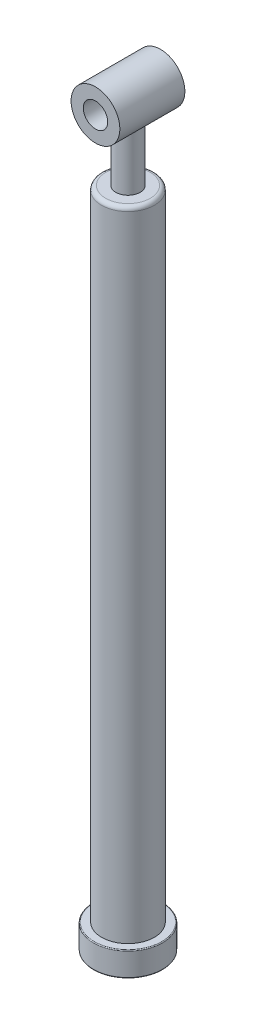
ISO-10303-21;
HEADER;
FILE_DESCRIPTION(('STEP AP214'),'2;1');
FILE_NAME('part.step','',(''),(''),'','','');
FILE_SCHEMA(('AUTOMOTIVE_DESIGN { 1 0 10303 214 1 1 1 1 }'));
ENDSEC;
DATA;
#1=APPLICATION_CONTEXT('core data for automotive mechanical design processes');
#2=APPLICATION_PROTOCOL_DEFINITION('international standard','automotive_design',2000,#1);
#3=PRODUCT_CONTEXT('',#1,'mechanical');
#4=PRODUCT('Part','Part','',(#3));
#5=PRODUCT_RELATED_PRODUCT_CATEGORY('part','',(#4));
#6=PRODUCT_DEFINITION_FORMATION('','',#4);
#7=PRODUCT_DEFINITION_CONTEXT('part definition',#1,'design');
#8=PRODUCT_DEFINITION('design','',#6,#7);
#9=PRODUCT_DEFINITION_SHAPE('','',#8);
#10=(LENGTH_UNIT() NAMED_UNIT(*) SI_UNIT(.MILLI.,.METRE.));
#11=(NAMED_UNIT(*) PLANE_ANGLE_UNIT() SI_UNIT($,.RADIAN.));
#12=(NAMED_UNIT(*) SI_UNIT($,.STERADIAN.) SOLID_ANGLE_UNIT());
#13=UNCERTAINTY_MEASURE_WITH_UNIT(LENGTH_MEASURE(1.E-05),#10,'distance_accuracy_value','');
#14=(GEOMETRIC_REPRESENTATION_CONTEXT(3) GLOBAL_UNCERTAINTY_ASSIGNED_CONTEXT((#13)) GLOBAL_UNIT_ASSIGNED_CONTEXT((#10,
#11,#12)) REPRESENTATION_CONTEXT('',''));
#15=CARTESIAN_POINT('',(0.,0.,0.));
#16=DIRECTION('',(0.,0.,1.));
#17=DIRECTION('',(1.,0.,0.));
#18=AXIS2_PLACEMENT_3D('',#15,#16,#17);
#19=CARTESIAN_POINT('',(0.,392.5,0.));
#20=DIRECTION('',(0.,-1.,0.));
#21=DIRECTION('',(0.,0.,-1.));
#22=AXIS2_PLACEMENT_3D('',#19,#20,#21);
#23=CYLINDRICAL_SURFACE('',#22,32.5);
#24=CARTESIAN_POINT('',(0.,387.5,0.));
#25=DIRECTION('',(0.,1.,0.));
#26=DIRECTION('',(0.,0.,1.));
#27=AXIS2_PLACEMENT_3D('',#24,#25,#26);
#28=CIRCLE('',#27,32.5);
#29=CARTESIAN_POINT('',(0.,387.5,32.5));
#30=VERTEX_POINT('',#29);
#31=EDGE_CURVE('E63',#30,#30,#28,.F.);
#32=ORIENTED_EDGE('',*,*,#31,.T.);
#33=EDGE_LOOP('',(#32));
#34=FACE_BOUND('',#33,.T.);
#35=CARTESIAN_POINT('',(0.,-392.5,0.));
#36=DIRECTION('',(0.,1.,0.));
#37=DIRECTION('',(0.,0.,1.));
#38=AXIS2_PLACEMENT_3D('',#35,#36,#37);
#39=CIRCLE('',#38,32.5);
#40=CARTESIAN_POINT('',(0.,-392.5,32.5));
#41=VERTEX_POINT('',#40);
#42=EDGE_CURVE('E71',#41,#41,#39,.T.);
#43=ORIENTED_EDGE('',*,*,#42,.T.);
#44=EDGE_LOOP('',(#43));
#45=FACE_BOUND('',#44,.T.);
#46=ADVANCED_FACE('F39',(#34,#45),#23,.T.);
#47=CARTESIAN_POINT('',(0.,392.5,0.));
#48=DIRECTION('',(0.,1.,0.));
#49=DIRECTION('',(0.,0.,1.));
#50=AXIS2_PLACEMENT_3D('',#47,#48,#49);
#51=PLANE('',#50);
#52=CARTESIAN_POINT('',(0.,392.5,0.));
#53=DIRECTION('',(0.,1.,0.));
#54=DIRECTION('',(0.,0.,1.));
#55=AXIS2_PLACEMENT_3D('',#52,#53,#54);
#56=CIRCLE('',#55,15.);
#57=CARTESIAN_POINT('',(0.,392.5,15.));
#58=VERTEX_POINT('',#57);
#59=EDGE_CURVE('E80',#58,#58,#56,.T.);
#60=ORIENTED_EDGE('',*,*,#59,.F.);
#61=EDGE_LOOP('',(#60));
#62=FACE_BOUND('',#61,.T.);
#63=CARTESIAN_POINT('',(0.,392.5,0.));
#64=DIRECTION('',(0.,1.,0.));
#65=DIRECTION('',(0.,0.,1.));
#66=AXIS2_PLACEMENT_3D('',#63,#64,#65);
#67=CIRCLE('',#66,27.5);
#68=CARTESIAN_POINT('',(0.,392.5,27.5));
#69=VERTEX_POINT('',#68);
#70=EDGE_CURVE('E67',#69,#69,#67,.T.);
#71=ORIENTED_EDGE('',*,*,#70,.T.);
#72=EDGE_LOOP('',(#71));
#73=FACE_BOUND('',#72,.T.);
#74=ADVANCED_FACE('F123',(#62,#73),#51,.T.);
#75=CARTESIAN_POINT('',(0.,387.5,0.));
#76=DIRECTION('',(0.,1.,0.));
#77=DIRECTION('',(0.,0.,1.));
#78=AXIS2_PLACEMENT_3D('',#75,#76,#77);
#79=TOROIDAL_SURFACE('',#78,27.5,5.);
#80=ORIENTED_EDGE('',*,*,#31,.F.);
#81=EDGE_LOOP('',(#80));
#82=FACE_BOUND('',#81,.T.);
#83=ORIENTED_EDGE('',*,*,#70,.F.);
#84=EDGE_LOOP('',(#83));
#85=FACE_BOUND('',#84,.T.);
#86=ADVANCED_FACE('F129',(#82,#85),#79,.T.);
#87=CARTESIAN_POINT('',(0.,-422.5,0.));
#88=DIRECTION('',(0.,1.,0.));
#89=DIRECTION('',(0.,0.,1.));
#90=AXIS2_PLACEMENT_3D('',#87,#88,#89);
#91=CYLINDRICAL_SURFACE('',#90,42.5);
#92=CARTESIAN_POINT('',(0.,-421.5,0.));
#93=DIRECTION('',(0.,-1.,0.));
#94=DIRECTION('',(0.,0.,-1.));
#95=AXIS2_PLACEMENT_3D('',#92,#93,#94);
#96=CIRCLE('',#95,42.5);
#97=CARTESIAN_POINT('',(0.,-421.5,-42.5));
#98=VERTEX_POINT('',#97);
#99=EDGE_CURVE('E47',#98,#98,#96,.F.);
#100=ORIENTED_EDGE('',*,*,#99,.T.);
#101=EDGE_LOOP('',(#100));
#102=FACE_BOUND('',#101,.T.);
#103=CARTESIAN_POINT('',(0.,-393.5,0.));
#104=DIRECTION('',(0.,-1.,0.));
#105=DIRECTION('',(0.,0.,-1.));
#106=AXIS2_PLACEMENT_3D('',#103,#104,#105);
#107=CIRCLE('',#106,42.5);
#108=CARTESIAN_POINT('',(0.,-393.5,-42.5));
#109=VERTEX_POINT('',#108);
#110=EDGE_CURVE('E52',#109,#109,#107,.T.);
#111=ORIENTED_EDGE('',*,*,#110,.T.);
#112=EDGE_LOOP('',(#111));
#113=FACE_BOUND('',#112,.T.);
#114=ADVANCED_FACE('F136',(#102,#113),#91,.T.);
#115=CARTESIAN_POINT('',(0.,-422.5,0.));
#116=DIRECTION('',(0.,-1.,0.));
#117=DIRECTION('',(0.,0.,-1.));
#118=AXIS2_PLACEMENT_3D('',#115,#116,#117);
#119=PLANE('',#118);
#120=CARTESIAN_POINT('',(0.,-422.5,0.));
#121=DIRECTION('',(0.,-1.,0.));
#122=DIRECTION('',(0.,0.,-1.));
#123=AXIS2_PLACEMENT_3D('',#120,#121,#122);
#124=CIRCLE('',#123,41.5);
#125=CARTESIAN_POINT('',(0.,-422.5,-41.5));
#126=VERTEX_POINT('',#125);
#127=EDGE_CURVE('E57',#126,#126,#124,.T.);
#128=ORIENTED_EDGE('',*,*,#127,.T.);
#129=EDGE_LOOP('',(#128));
#130=FACE_BOUND('',#129,.T.);
#131=CARTESIAN_POINT('',(0.,-422.5,0.));
#132=DIRECTION('',(0.,-1.,0.));
#133=DIRECTION('',(0.,0.,-1.));
#134=AXIS2_PLACEMENT_3D('',#131,#132,#133);
#135=CIRCLE('',#134,20.);
#136=CARTESIAN_POINT('',(0.,-422.5,-20.));
#137=VERTEX_POINT('',#136);
#138=EDGE_CURVE('E76',#137,#137,#135,.T.);
#139=ORIENTED_EDGE('',*,*,#138,.F.);
#140=EDGE_LOOP('',(#139));
#141=FACE_BOUND('',#140,.T.);
#142=ADVANCED_FACE('F141',(#130,#141),#119,.T.);
#143=CARTESIAN_POINT('',(0.,-392.5,0.));
#144=DIRECTION('',(0.,-1.,0.));
#145=DIRECTION('',(0.,0.,-1.));
#146=AXIS2_PLACEMENT_3D('',#143,#144,#145);
#147=PLANE('',#146);
#148=CARTESIAN_POINT('',(0.,-392.5,0.));
#149=DIRECTION('',(0.,-1.,0.));
#150=DIRECTION('',(0.,0.,-1.));
#151=AXIS2_PLACEMENT_3D('',#148,#149,#150);
#152=CIRCLE('',#151,41.5);
#153=CARTESIAN_POINT('',(0.,-392.5,-41.5));
#154=VERTEX_POINT('',#153);
#155=EDGE_CURVE('E10',#154,#154,#152,.F.);
#156=ORIENTED_EDGE('',*,*,#155,.T.);
#157=EDGE_LOOP('',(#156));
#158=FACE_BOUND('',#157,.T.);
#159=ORIENTED_EDGE('',*,*,#42,.F.);
#160=EDGE_LOOP('',(#159));
#161=FACE_BOUND('',#160,.T.);
#162=ADVANCED_FACE('F149',(#158,#161),#147,.F.);
#163=CARTESIAN_POINT('',(0.,387.5,0.));
#164=DIRECTION('',(0.,-1.,0.));
#165=DIRECTION('',(0.,0.,-1.));
#166=AXIS2_PLACEMENT_3D('',#163,#164,#165);
#167=CYLINDRICAL_SURFACE('',#166,20.);
#168=CARTESIAN_POINT('',(0.,387.5,0.));
#169=DIRECTION('',(0.,-1.,0.));
#170=DIRECTION('',(0.,0.,-1.));
#171=AXIS2_PLACEMENT_3D('',#168,#169,#170);
#172=CIRCLE('',#171,20.);
#173=CARTESIAN_POINT('',(0.,387.5,-20.));
#174=VERTEX_POINT('',#173);
#175=EDGE_CURVE('E75',#174,#174,#172,.T.);
#176=ORIENTED_EDGE('',*,*,#175,.F.);
#177=EDGE_LOOP('',(#176));
#178=FACE_BOUND('',#177,.T.);
#179=ORIENTED_EDGE('',*,*,#138,.T.);
#180=EDGE_LOOP('',(#179));
#181=FACE_BOUND('',#180,.T.);
#182=ADVANCED_FACE('F155',(#178,#181),#167,.F.);
#183=CARTESIAN_POINT('',(0.,387.5,0.));
#184=DIRECTION('',(0.,-1.,0.));
#185=DIRECTION('',(0.,0.,-1.));
#186=AXIS2_PLACEMENT_3D('',#183,#184,#185);
#187=PLANE('',#186);
#188=ORIENTED_EDGE('',*,*,#175,.T.);
#189=EDGE_LOOP('',(#188));
#190=FACE_BOUND('',#189,.T.);
#191=ADVANCED_FACE('F158',(#190),#187,.T.);
#192=CARTESIAN_POINT('',(0.,517.502,0.));
#193=DIRECTION('',(0.,-1.,0.));
#194=DIRECTION('',(0.,0.,-1.));
#195=AXIS2_PLACEMENT_3D('',#192,#193,#194);
#196=CYLINDRICAL_SURFACE('',#195,15.);
#197=ORIENTED_EDGE('',*,*,#59,.T.);
#198=EDGE_LOOP('',(#197));
#199=FACE_BOUND('',#198,.T.);
#200=CARTESIAN_POINT('',(0.,457.5,-15.));
#201=CARTESIAN_POINT('',(-0.394466621474773,457.500001198443,-14.9999986967893));
#202=CARTESIAN_POINT('',(-0.788960822893598,457.507798374441,-14.9844217290986));
#203=CARTESIAN_POINT('',(-1.57504384672488,457.538790696875,-14.9222912626951));
#204=CARTESIAN_POINT('',(-1.96663133023564,457.561992541911,-14.8757242881962));
#205=CARTESIAN_POINT('',(-2.74444839066597,457.623245665513,-14.752062134402));
#206=CARTESIAN_POINT('',(-3.13066783309047,457.661321887591,-14.674915671778));
#207=CARTESIAN_POINT('',(-3.89427274204148,457.751345482788,-14.4909926788045));
#208=CARTESIAN_POINT('',(-4.27165908796738,457.803291468628,-14.3842191117729));
#209=CARTESIAN_POINT('',(-5.01370255233914,457.919545464834,-14.1426464967422));
#210=CARTESIAN_POINT('',(-5.37840368544457,457.983804328683,-14.0079586988167));
#211=CARTESIAN_POINT('',(-6.09447648128181,458.123301187506,-13.7115835174738));
#212=CARTESIAN_POINT('',(-6.4458478568234,458.198539418861,-13.5498955527415));
#213=CARTESIAN_POINT('',(-7.13327098283041,458.358261390877,-13.2009461452605));
#214=CARTESIAN_POINT('',(-7.4693283295993,458.442741715132,-13.0136941461367));
#215=CARTESIAN_POINT('',(-8.12479620523716,458.619159593015,-12.6148696065897));
#216=CARTESIAN_POINT('',(-8.44420009848105,458.711100082431,-12.4032874777652));
#217=CARTESIAN_POINT('',(-9.08356730455507,458.906169485422,-11.9437431549207));
#218=CARTESIAN_POINT('',(-9.40240338911198,459.009638755958,-11.6943566948693));
#219=CARTESIAN_POINT('',(-10.0182110858624,459.220301058942,-11.1713323045257));
#220=CARTESIAN_POINT('',(-10.3151814463611,459.327494304051,-10.8976929878613));
#221=CARTESIAN_POINT('',(-10.8860835918351,459.543134053405,-10.32744213221));
#222=CARTESIAN_POINT('',(-11.1600008976787,459.651581297343,-10.0308163772597));
#223=CARTESIAN_POINT('',(-11.6833254232374,459.867048472574,-9.41609706949252));
#224=CARTESIAN_POINT('',(-11.9327280363632,459.974068132355,-9.09799950074794));
#225=CARTESIAN_POINT('',(-12.424066666325,460.192119687857,-8.41621019135652));
#226=CARTESIAN_POINT('',(-12.6639084928374,460.302814953086,-8.0508969312816));
#227=CARTESIAN_POINT('',(-13.1116371457317,460.51581142987,-7.29906225682781));
#228=CARTESIAN_POINT('',(-13.319537514021,460.618116190041,-6.91254992484984));
#229=CARTESIAN_POINT('',(-13.7015816677248,460.810817756053,-6.12045119528937));
#230=CARTESIAN_POINT('',(-13.8757356708104,460.90121816361,-5.71487061752194));
#231=CARTESIAN_POINT('',(-14.1884178363296,461.066685065391,-4.88717106989481));
#232=CARTESIAN_POINT('',(-14.3269499463523,461.141753258529,-4.46505393858206));
#233=CARTESIAN_POINT('',(-14.5593818816456,461.269465636118,-3.63312743966091));
#234=CARTESIAN_POINT('',(-14.6554546162323,461.323181991672,-3.22409061692207));
#235=CARTESIAN_POINT('',(-14.8131483158836,461.412093372582,-2.39742530260421));
#236=CARTESIAN_POINT('',(-14.874770754679,461.447289190215,-1.97979717934039));
#237=CARTESIAN_POINT('',(-14.9625716596024,461.497615020556,-1.13997809784131));
#238=CARTESIAN_POINT('',(-14.9887801055065,461.512762005415,-0.717791304375873));
#239=CARTESIAN_POINT('',(-15.0054120092055,461.522361014937,0.127503752153181));
#240=CARTESIAN_POINT('',(-14.9958388811994,461.516815014078,0.550611923450817));
#241=CARTESIAN_POINT('',(-14.9443693637688,461.487185469988,1.34318604493254));
#242=CARTESIAN_POINT('',(-14.9064815133301,461.465401642622,1.71300749674339));
#243=CARTESIAN_POINT('',(-14.8036048078167,461.40676729953,2.44761394651884));
#244=CARTESIAN_POINT('',(-14.7386184959446,461.369918197694,2.81239941379461));
#245=CARTESIAN_POINT('',(-14.5822778462236,461.282349877418,3.53465011425934));
#246=CARTESIAN_POINT('',(-14.490916902454,461.231627184297,3.89211348946939));
#247=CARTESIAN_POINT('',(-14.2827793732036,461.117879915435,4.5975509702241));
#248=CARTESIAN_POINT('',(-14.1660014339124,461.054854684428,4.94552456919406));
#249=CARTESIAN_POINT('',(-13.9051185945145,460.916735657268,5.63806138553527));
#250=CARTESIAN_POINT('',(-13.7604466030275,460.841397479624,5.98236177926317));
#251=CARTESIAN_POINT('',(-13.4467240006948,460.681786349803,6.65764881287024));
#252=CARTESIAN_POINT('',(-13.2776646708395,460.597510204973,6.98863063670926));
#253=CARTESIAN_POINT('',(-12.9163207460711,460.422168121219,7.63583954119815));
#254=CARTESIAN_POINT('',(-12.7240325037789,460.331101116863,7.95206429387363));
#255=CARTESIAN_POINT('',(-12.3173373374606,460.144319137144,8.56852275615356));
#256=CARTESIAN_POINT('',(-12.1029286391493,460.048603789262,8.86875518007756));
#257=CARTESIAN_POINT('',(-11.6244221009995,459.842288154575,9.48921356105551));
#258=CARTESIAN_POINT('',(-11.357472454083,459.73134228918,9.80713018813409));
#259=CARTESIAN_POINT('',(-10.7983337273758,459.509171948651,10.4195910602953));
#260=CARTESIAN_POINT('',(-10.5061534517949,459.397947583749,10.7141433900476));
#261=CARTESIAN_POINT('',(-9.897619105829,459.177890344788,11.2787205781467));
#262=CARTESIAN_POINT('',(-9.58124396820908,459.069059663621,11.5487236024522));
#263=CARTESIAN_POINT('',(-8.92619254193719,458.856648454252,12.0621805278786));
#264=CARTESIAN_POINT('',(-8.58752523371368,458.753065841263,12.3056450163623));
#265=CARTESIAN_POINT('',(-7.87309152384947,458.549027950798,12.7751937974681));
#266=CARTESIAN_POINT('',(-7.49633062281165,458.44894596163,12.999931268877));
#267=CARTESIAN_POINT('',(-6.72229496746225,458.260139769321,13.4165538554255));
#268=CARTESIAN_POINT('',(-6.32501925897375,458.171416095143,13.608437440683));
#269=CARTESIAN_POINT('',(-5.51289034160745,458.007976152198,13.9571914545699));
#270=CARTESIAN_POINT('',(-5.09804850978523,457.933250982128,14.1140841452216));
#271=CARTESIAN_POINT('',(-4.25373396764104,457.800028469866,14.391076168471));
#272=CARTESIAN_POINT('',(-3.82426294674313,457.741529260936,14.5111797336915));
#273=CARTESIAN_POINT('',(-2.99040123124789,457.646713024642,14.7045987917793));
#274=CARTESIAN_POINT('',(-2.58687987737182,457.608959937918,14.780965864728));
#275=CARTESIAN_POINT('',(-1.77375891598893,457.549709617987,14.9004227368483));
#276=CARTESIAN_POINT('',(-1.36415964033065,457.528211500579,14.9435143460633));
#277=CARTESIAN_POINT('',(-0.542432179601618,457.502088586177,14.9958394822899));
#278=CARTESIAN_POINT('',(-0.130305071717035,457.497457042783,15.0050865466642));
#279=CARTESIAN_POINT('',(0.693142933067776,457.505182902425,14.9896332143828));
#280=CARTESIAN_POINT('',(1.10446386484084,457.517539553599,14.9649343201033));
#281=CARTESIAN_POINT('',(1.89104365716466,457.557274299687,14.8851569218173));
#282=CARTESIAN_POINT('',(2.26662317638414,457.583411784036,14.8325856924447));
#283=CARTESIAN_POINT('',(3.01155508953994,457.649198828482,14.6994449555599));
#284=CARTESIAN_POINT('',(3.38090788254088,457.688847519178,14.6188772495211));
#285=CARTESIAN_POINT('',(4.11102643115708,457.780732355606,14.4305792041858));
#286=CARTESIAN_POINT('',(4.47179170797617,457.832969201392,14.322847354219));
#287=CARTESIAN_POINT('',(5.18257720416892,457.948848110263,14.0812572947496));
#288=CARTESIAN_POINT('',(5.53259697135357,458.012490652549,13.9473979874992));
#289=CARTESIAN_POINT('',(6.22979935488013,458.151753782206,13.6505393721982));
#290=CARTESIAN_POINT('',(6.57661612017298,458.227664302393,13.4868176517073));
#291=CARTESIAN_POINT('',(7.25508680349725,458.38839960015,13.1343016754682));
#292=CARTESIAN_POINT('',(7.58674058826879,458.473224456043,12.9455071994249));
#293=CARTESIAN_POINT('',(8.23341158684487,458.649985850757,12.5441531585986));
#294=CARTESIAN_POINT('',(8.54842613296239,458.741923524154,12.3315897999932));
#295=CARTESIAN_POINT('',(9.16054648853283,458.931012285166,11.8839483671783));
#296=CARTESIAN_POINT('',(9.45764526147814,459.028165393215,11.6488615394067));
#297=CARTESIAN_POINT('',(10.060839107335,459.235341464201,11.1333715012893));
#298=CARTESIAN_POINT('',(10.3649587307601,459.345692143983,10.8507851186195));
#299=CARTESIAN_POINT('',(10.9485707923032,459.567469299411,10.2616154855625));
#300=CARTESIAN_POINT('',(11.2280621358616,459.678895822626,9.95503116977257));
#301=CARTESIAN_POINT('',(11.761157874002,459.900027289832,9.31919419442996));
#302=CARTESIAN_POINT('',(12.0147464980315,460.00973115101,8.98992792709477));
#303=CARTESIAN_POINT('',(12.4944228999317,460.224397948994,8.31037887445768));
#304=CARTESIAN_POINT('',(12.7205059505332,460.329360068912,7.96009249191952));
#305=CARTESIAN_POINT('',(13.1539172060939,460.536414537209,7.22261605950785));
#306=CARTESIAN_POINT('',(13.3597919511091,460.638116937489,6.83445930863629));
#307=CARTESIAN_POINT('',(13.737567232961,460.829340387484,6.03927850598328));
#308=CARTESIAN_POINT('',(13.9094843147169,460.918867362678,5.63226376216402));
#309=CARTESIAN_POINT('',(14.2174151642657,461.082288068273,4.80217565091482));
#310=CARTESIAN_POINT('',(14.353457663537,461.156194299646,4.37911544662187));
#311=CARTESIAN_POINT('',(14.5879514095295,461.28531598748,3.51992505793522));
#312=CARTESIAN_POINT('',(14.6864084766722,461.340534337767,3.08379690851379));
#313=CARTESIAN_POINT('',(14.8366134509912,461.425460869571,2.24471283239244));
#314=CARTESIAN_POINT('',(14.8919378625023,461.457109030588,1.84259137531864));
#315=CARTESIAN_POINT('',(14.9698153891526,461.5017947784,1.03415900372211));
#316=CARTESIAN_POINT('',(14.9923707330054,461.514833630864,0.627848376009434));
#317=CARTESIAN_POINT('',(15.0043645010929,461.521757365319,-0.18527035150796));
#318=CARTESIAN_POINT('',(14.9938151743778,461.515649331845,-0.592078211651138));
#319=CARTESIAN_POINT('',(14.9397884815991,461.484549012312,-1.40275816467969));
#320=CARTESIAN_POINT('',(14.8963124635393,461.459557499333,-1.8066303770658));
#321=CARTESIAN_POINT('',(14.782795841076,461.394967278986,-2.56967168244059));
#322=CARTESIAN_POINT('',(14.7156934571528,461.356994150101,-2.92942204471817));
#323=CARTESIAN_POINT('',(14.5558242789108,461.267646667704,-3.64159381579529));
#324=CARTESIAN_POINT('',(14.4630489945772,461.216267881271,-3.99401275857395));
#325=CARTESIAN_POINT('',(14.2527724980854,461.101651711384,-4.6893964800036));
#326=CARTESIAN_POINT('',(14.1352709916016,461.038414186773,-5.03236114606178));
#327=CARTESIAN_POINT('',(13.8765585244577,460.901832636467,-5.70716431681699));
#328=CARTESIAN_POINT('',(13.7353452308956,460.828487616466,-6.03900172289249));
#329=CARTESIAN_POINT('',(13.4200195538922,460.66836954442,-6.71194905721807));
#330=CARTESIAN_POINT('',(13.2443351386714,460.581025622915,-7.05218633738285));
#331=CARTESIAN_POINT('',(12.8684192321827,460.399310742732,-7.71683729888766));
#332=CARTESIAN_POINT('',(12.6681869929773,460.304939569978,-8.04125049766908));
#333=CARTESIAN_POINT('',(12.2442855818538,460.111466647555,-8.67307599887718));
#334=CARTESIAN_POINT('',(12.0206075892618,460.012363125188,-8.98048183592639));
#335=CARTESIAN_POINT('',(11.5509819278367,459.811734819274,-9.57700095794094));
#336=CARTESIAN_POINT('',(11.3050309237573,459.710209674785,-9.86611149224955));
#337=CARTESIAN_POINT('',(10.7607009160988,459.494588016576,-10.4588881043877));
#338=CARTESIAN_POINT('',(10.4595848725634,459.380466375821,-10.7600384098886));
#339=CARTESIAN_POINT('',(9.83237263592984,459.155062843985,-11.3360350079751));
#340=CARTESIAN_POINT('',(9.50628425805798,459.043780078879,-11.6108894699081));
#341=CARTESIAN_POINT('',(8.8304006449509,458.826840554529,-12.1328673274452));
#342=CARTESIAN_POINT('',(8.48058689086185,458.721188307768,-12.3799686513199));
#343=CARTESIAN_POINT('',(7.75934315416604,458.518404213271,-12.8443186951047));
#344=CARTESIAN_POINT('',(7.38791441884538,458.421271874707,-13.0615691351246));
#345=CARTESIAN_POINT('',(6.62283359834587,458.237499586337,-13.4657554418474));
#346=CARTESIAN_POINT('',(6.22904153096556,458.150939674485,-13.652463307469));
#347=CARTESIAN_POINT('',(5.42422205013373,457.991593102566,-13.9917304392215));
#348=CARTESIAN_POINT('',(5.01319217734312,457.918808416049,-14.1442848128173));
#349=CARTESIAN_POINT('',(4.17809175418139,457.789368363161,-14.4130312534336));
#350=CARTESIAN_POINT('',(3.75405665560563,457.732672834932,-14.52931393542));
#351=CARTESIAN_POINT('',(2.8957098332815,457.636960690795,-14.7244141315277));
#352=CARTESIAN_POINT('',(2.46140455781257,457.597933276359,-14.8032545313493));
#353=CARTESIAN_POINT('',(1.68912528485809,457.54570850057,-14.9084233559045));
#354=CARTESIAN_POINT('',(1.35247752005868,457.528597786956,-14.9427351996439));
#355=CARTESIAN_POINT('',(0.677226647280006,457.505742865413,-14.9885243961843));
#356=CARTESIAN_POINT('',(0.338623485589115,457.499998971216,-15.0000011187201));
#357=CARTESIAN_POINT('',(0.,457.5,-15.));
#358=B_SPLINE_CURVE_WITH_KNOTS('',3,(#200,#201,#202,#203,#204,#205,#206,#207,#208,#209,#210,
#211,#212,#213,#214,#215,#216,#217,#218,#219,#220,#221,#222,#223,#224,#225,#226,#227,#228,#229,
#230,#231,#232,#233,#234,#235,#236,#237,#238,#239,#240,#241,#242,#243,#244,#245,#246,#247,#248,
#249,#250,#251,#252,#253,#254,#255,#256,#257,#258,#259,#260,#261,#262,#263,#264,#265,#266,#267,
#268,#269,#270,#271,#272,#273,#274,#275,#276,#277,#278,#279,#280,#281,#282,#283,#284,#285,#286,
#287,#288,#289,#290,#291,#292,#293,#294,#295,#296,#297,#298,#299,#300,#301,#302,#303,#304,#305,
#306,#307,#308,#309,#310,#311,#312,#313,#314,#315,#316,#317,#318,#319,#320,#321,#322,#323,#324,
#325,#326,#327,#328,#329,#330,#331,#332,#333,#334,#335,#336,#337,#338,#339,#340,#341,#342,#343,
#344,#345,#346,#347,#348,#349,#350,#351,#352,#353,#354,#355,#356,#357),.UNSPECIFIED.,.T.,.F.,(4,
2,2,2,2,2,2,2,2,2,2,2,2,2,2,2,2,2,2,2,2,2,2,2,2,2,2,2,2,2,2,2,2,2,2,2,2,2,2,2,2,2,2,2,2,2,2,2,2,
2,2,2,2,2,2,2,2,2,2,2,2,2,2,2,2,2,2,2,2,2,2,2,2,2,2,2,2,2,4),(0.,1.1830658838765,
2.36664655205927,3.55222059958419,4.73767610811697,5.91849492154762,7.09933916134023,
8.27974835920212,9.46062435602729,10.7126941080732,11.9648354787242,13.2177575130875,
14.4709145374423,15.821667201721,17.1718456109054,18.5216145742371,19.8712338927467,
21.1401798733571,22.4090715662491,23.6768884023223,24.9445842691984,26.0604534443427,
27.1762179182402,28.2922620948529,29.4083657309784,30.5501573825651,31.6923582661888,
32.8347387306653,33.9772108970053,35.2649000045823,36.5521415758273,37.8405170382692,
39.1283766165387,40.4765138704575,41.824713885002,43.1720536807209,44.519238405488,
45.7548292237563,46.9903528264139,48.2253821822107,49.4603568799793,50.5994583371909,
51.7384865108584,52.8775780428886,54.0167174442702,55.188356729037,56.3600063087793,
57.53184316668,58.7041373111917,59.9914055352966,61.2787309408958,62.5668355046821,
63.8551611378706,65.2063513889894,66.5568816778176,67.9063270370394,69.2555633384069,
70.4752824018563,71.6949185050053,72.9141033841497,74.1332383531127,75.2357784731186,
76.3386836391977,77.4416019343193,78.5446288045349,79.7216927437009,80.8987925552604,
82.0763368112874,83.2540576898124,84.5752168212047,85.895964165236,87.2177545550281,
88.5394687467831,89.8706389488176,91.2019997209938,92.5300073067729,93.8572021316087,
94.872757858524,95.8883416150966),.UNSPECIFIED.);
#359=CARTESIAN_POINT('',(0.,457.5,-15.));
#360=VERTEX_POINT('',#359);
#361=EDGE_CURVE('E84',#360,#360,#358,.T.);
#362=ORIENTED_EDGE('',*,*,#361,.F.);
#363=EDGE_LOOP('',(#362));
#364=FACE_BOUND('',#363,.T.);
#365=ADVANCED_FACE('F95',(#199,#364),#196,.T.);
#366=CARTESIAN_POINT('',(0.,487.5,40.));
#367=DIRECTION('',(0.,0.,-1.));
#368=DIRECTION('',(-1.,0.,0.));
#369=AXIS2_PLACEMENT_3D('',#366,#367,#368);
#370=CYLINDRICAL_SURFACE('',#369,30.);
#371=CARTESIAN_POINT('',(0.,487.5,-40.));
#372=DIRECTION('',(0.,0.,1.));
#373=DIRECTION('',(1.,0.,0.));
#374=AXIS2_PLACEMENT_3D('',#371,#372,#373);
#375=CIRCLE('',#374,30.);
#376=CARTESIAN_POINT('',(30.,487.5,-40.));
#377=VERTEX_POINT('',#376);
#378=EDGE_CURVE('E181',#377,#377,#375,.T.);
#379=ORIENTED_EDGE('',*,*,#378,.T.);
#380=EDGE_LOOP('',(#379));
#381=FACE_BOUND('',#380,.T.);
#382=CARTESIAN_POINT('',(0.,487.5,40.));
#383=DIRECTION('',(0.,0.,1.));
#384=DIRECTION('',(1.,0.,0.));
#385=AXIS2_PLACEMENT_3D('',#382,#383,#384);
#386=CIRCLE('',#385,30.);
#387=CARTESIAN_POINT('',(30.,487.5,40.));
#388=VERTEX_POINT('',#387);
#389=EDGE_CURVE('E93',#388,#388,#386,.T.);
#390=ORIENTED_EDGE('',*,*,#389,.F.);
#391=EDGE_LOOP('',(#390));
#392=FACE_BOUND('',#391,.T.);
#393=ORIENTED_EDGE('',*,*,#361,.T.);
#394=EDGE_LOOP('',(#393));
#395=FACE_BOUND('',#394,.T.);
#396=ADVANCED_FACE('F100',(#381,#392,#395),#370,.T.);
#397=CARTESIAN_POINT('',(0.,487.5,40.));
#398=DIRECTION('',(0.,0.,1.));
#399=DIRECTION('',(1.,0.,0.));
#400=AXIS2_PLACEMENT_3D('',#397,#398,#399);
#401=PLANE('',#400);
#402=ORIENTED_EDGE('',*,*,#389,.T.);
#403=EDGE_LOOP('',(#402));
#404=FACE_BOUND('',#403,.T.);
#405=CARTESIAN_POINT('',(0.,487.5,40.));
#406=DIRECTION('',(0.,0.,1.));
#407=DIRECTION('',(1.,0.,0.));
#408=AXIS2_PLACEMENT_3D('',#405,#406,#407);
#409=CIRCLE('',#408,15.);
#410=CARTESIAN_POINT('',(15.,487.5,40.));
#411=VERTEX_POINT('',#410);
#412=EDGE_CURVE('E185',#411,#411,#409,.T.);
#413=ORIENTED_EDGE('',*,*,#412,.F.);
#414=EDGE_LOOP('',(#413));
#415=FACE_BOUND('',#414,.T.);
#416=ADVANCED_FACE('F103',(#404,#415),#401,.T.);
#417=CARTESIAN_POINT('',(0.,487.5,-40.));
#418=DIRECTION('',(0.,0.,1.));
#419=DIRECTION('',(1.,0.,0.));
#420=AXIS2_PLACEMENT_3D('',#417,#418,#419);
#421=PLANE('',#420);
#422=ORIENTED_EDGE('',*,*,#378,.F.);
#423=EDGE_LOOP('',(#422));
#424=FACE_BOUND('',#423,.T.);
#425=CARTESIAN_POINT('',(0.,487.5,-40.));
#426=DIRECTION('',(0.,0.,1.));
#427=DIRECTION('',(1.,0.,0.));
#428=AXIS2_PLACEMENT_3D('',#425,#426,#427);
#429=CIRCLE('',#428,15.);
#430=CARTESIAN_POINT('',(15.,487.5,-40.));
#431=VERTEX_POINT('',#430);
#432=EDGE_CURVE('E187',#431,#431,#429,.T.);
#433=ORIENTED_EDGE('',*,*,#432,.T.);
#434=EDGE_LOOP('',(#433));
#435=FACE_BOUND('',#434,.T.);
#436=ADVANCED_FACE('F105',(#424,#435),#421,.F.);
#437=CARTESIAN_POINT('',(0.,487.5,40.));
#438=DIRECTION('',(0.,0.,-1.));
#439=DIRECTION('',(-1.,0.,0.));
#440=AXIS2_PLACEMENT_3D('',#437,#438,#439);
#441=CYLINDRICAL_SURFACE('',#440,15.);
#442=ORIENTED_EDGE('',*,*,#412,.T.);
#443=EDGE_LOOP('',(#442));
#444=FACE_BOUND('',#443,.T.);
#445=ORIENTED_EDGE('',*,*,#432,.F.);
#446=EDGE_LOOP('',(#445));
#447=FACE_BOUND('',#446,.T.);
#448=ADVANCED_FACE('F108',(#444,#447),#441,.F.);
#449=CARTESIAN_POINT('',(0.,-421.5,0.));
#450=DIRECTION('',(0.,-1.,0.));
#451=DIRECTION('',(0.,0.,-1.));
#452=AXIS2_PLACEMENT_3D('',#449,#450,#451);
#453=TOROIDAL_SURFACE('',#452,41.5,1.);
#454=ORIENTED_EDGE('',*,*,#99,.F.);
#455=EDGE_LOOP('',(#454));
#456=FACE_BOUND('',#455,.T.);
#457=ORIENTED_EDGE('',*,*,#127,.F.);
#458=EDGE_LOOP('',(#457));
#459=FACE_BOUND('',#458,.T.);
#460=ADVANCED_FACE('F114',(#456,#459),#453,.T.);
#461=CARTESIAN_POINT('',(0.,-393.5,0.));
#462=DIRECTION('',(0.,-1.,0.));
#463=DIRECTION('',(0.,0.,-1.));
#464=AXIS2_PLACEMENT_3D('',#461,#462,#463);
#465=TOROIDAL_SURFACE('',#464,41.5,1.);
#466=ORIENTED_EDGE('',*,*,#155,.F.);
#467=EDGE_LOOP('',(#466));
#468=FACE_BOUND('',#467,.T.);
#469=ORIENTED_EDGE('',*,*,#110,.F.);
#470=EDGE_LOOP('',(#469));
#471=FACE_BOUND('',#470,.T.);
#472=ADVANCED_FACE('F41',(#468,#471),#465,.T.);
#473=CLOSED_SHELL('',(#46,#74,#86,#114,#142,#162,#182,#191,#365,#396,#416,#436,#448,#460,#472));
#474=MANIFOLD_SOLID_BREP('B2',#473);
#475=ADVANCED_BREP_SHAPE_REPRESENTATION('',(#18,#474),#14);
#476=SHAPE_DEFINITION_REPRESENTATION(#9,#475);
ENDSEC;
END-ISO-10303-21;
